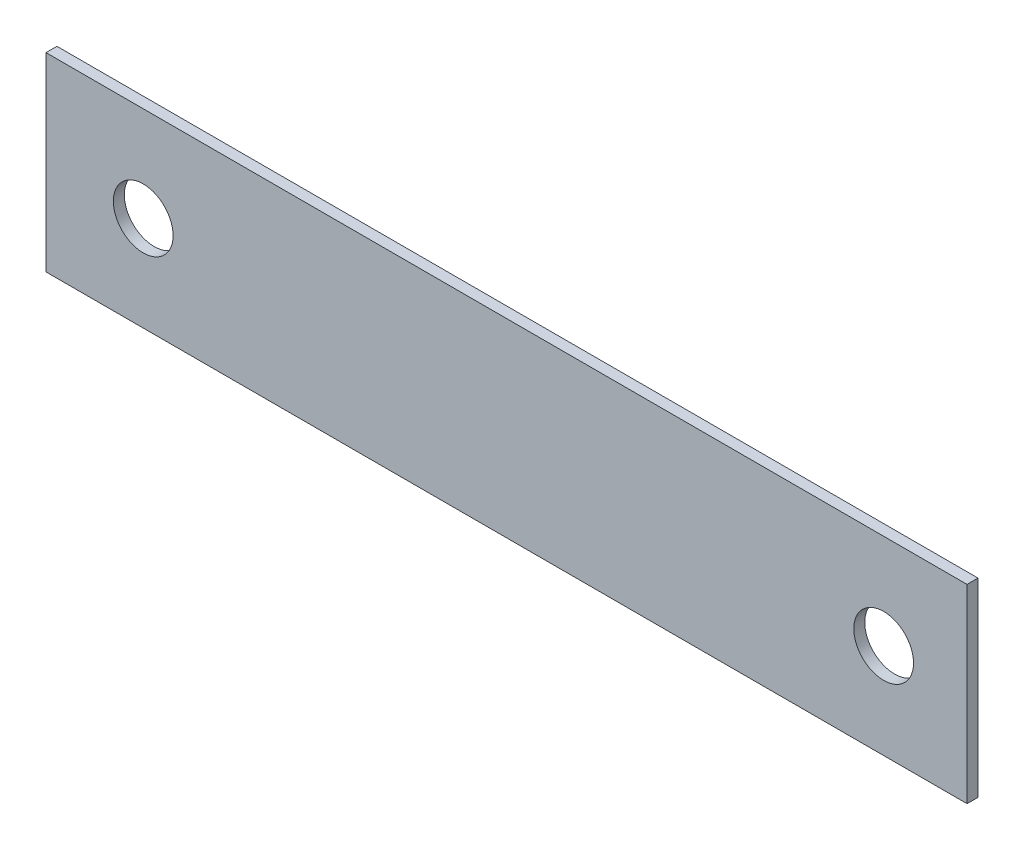
ISO-10303-21;
HEADER;
FILE_DESCRIPTION(('STEP AP214'),'2;1');
FILE_NAME('part.step','',(''),(''),'','','');
FILE_SCHEMA(('AUTOMOTIVE_DESIGN { 1 0 10303 214 1 1 1 1 }'));
ENDSEC;
DATA;
#1=APPLICATION_CONTEXT('core data for automotive mechanical design processes');
#2=APPLICATION_PROTOCOL_DEFINITION('international standard','automotive_design',2000,#1);
#3=PRODUCT_CONTEXT('',#1,'mechanical');
#4=PRODUCT('Part','Part','',(#3));
#5=PRODUCT_RELATED_PRODUCT_CATEGORY('part','',(#4));
#6=PRODUCT_DEFINITION_FORMATION('','',#4);
#7=PRODUCT_DEFINITION_CONTEXT('part definition',#1,'design');
#8=PRODUCT_DEFINITION('design','',#6,#7);
#9=PRODUCT_DEFINITION_SHAPE('','',#8);
#10=(LENGTH_UNIT() NAMED_UNIT(*) SI_UNIT(.MILLI.,.METRE.));
#11=(NAMED_UNIT(*) PLANE_ANGLE_UNIT() SI_UNIT($,.RADIAN.));
#12=(NAMED_UNIT(*) SI_UNIT($,.STERADIAN.) SOLID_ANGLE_UNIT());
#13=UNCERTAINTY_MEASURE_WITH_UNIT(LENGTH_MEASURE(1.E-05),#10,'distance_accuracy_value','');
#14=(GEOMETRIC_REPRESENTATION_CONTEXT(3) GLOBAL_UNCERTAINTY_ASSIGNED_CONTEXT((#13)) GLOBAL_UNIT_ASSIGNED_CONTEXT((#10,
#11,#12)) REPRESENTATION_CONTEXT('',''));
#15=CARTESIAN_POINT('',(0.,0.,0.));
#16=DIRECTION('',(0.,0.,1.));
#17=DIRECTION('',(1.,0.,0.));
#18=AXIS2_PLACEMENT_3D('',#15,#16,#17);
#19=CARTESIAN_POINT('',(0.,0.,0.));
#20=DIRECTION('',(0.,0.,-1.));
#21=DIRECTION('',(-1.,0.,0.));
#22=AXIS2_PLACEMENT_3D('',#19,#20,#21);
#23=PLANE('',#22);
#24=CARTESIAN_POINT('',(-14.5941080196399,0.,0.));
#25=DIRECTION('',(0.,0.,1.));
#26=DIRECTION('',(1.,0.,0.));
#27=AXIS2_PLACEMENT_3D('',#24,#25,#26);
#28=CIRCLE('',#27,1.2);
#29=CARTESIAN_POINT('',(-13.3941080196399,0.,0.));
#30=VERTEX_POINT('',#29);
#31=EDGE_CURVE('E244',#30,#30,#28,.T.);
#32=ORIENTED_EDGE('',*,*,#31,.T.);
#33=EDGE_LOOP('',(#32));
#34=FACE_BOUND('',#33,.T.);
#35=DIRECTION('',(0.,1.,0.));
#36=VECTOR('',#35,1.);
#37=CARTESIAN_POINT('',(18.5,-3.815,0.));
#38=LINE('',#37,#36);
#39=CARTESIAN_POINT('',(18.5,-3.815,0.));
#40=VERTEX_POINT('',#39);
#41=CARTESIAN_POINT('',(18.5,3.815,0.));
#42=VERTEX_POINT('',#41);
#43=EDGE_CURVE('E252',#40,#42,#38,.T.);
#44=ORIENTED_EDGE('',*,*,#43,.F.);
#45=DIRECTION('',(1.,0.,0.));
#46=VECTOR('',#45,1.);
#47=CARTESIAN_POINT('',(-18.5,-3.815,0.));
#48=LINE('',#47,#46);
#49=CARTESIAN_POINT('',(-18.5,-3.815,0.));
#50=VERTEX_POINT('',#49);
#51=EDGE_CURVE('E261',#50,#40,#48,.T.);
#52=ORIENTED_EDGE('',*,*,#51,.F.);
#53=DIRECTION('',(0.,-1.,0.));
#54=VECTOR('',#53,1.);
#55=CARTESIAN_POINT('',(-18.5,-3.815,0.));
#56=LINE('',#55,#54);
#57=CARTESIAN_POINT('',(-18.5,3.815,0.));
#58=VERTEX_POINT('',#57);
#59=EDGE_CURVE('E277',#58,#50,#56,.T.);
#60=ORIENTED_EDGE('',*,*,#59,.F.);
#61=DIRECTION('',(-1.,0.,0.));
#62=VECTOR('',#61,1.);
#63=CARTESIAN_POINT('',(-18.5,3.815,0.));
#64=LINE('',#63,#62);
#65=EDGE_CURVE('E274',#42,#58,#64,.T.);
#66=ORIENTED_EDGE('',*,*,#65,.F.);
#67=EDGE_LOOP('',(#44,#52,#60,#66));
#68=FACE_BOUND('',#67,.T.);
#69=CARTESIAN_POINT('',(15.15,0.,0.));
#70=DIRECTION('',(0.,0.,1.));
#71=DIRECTION('',(1.,0.,0.));
#72=AXIS2_PLACEMENT_3D('',#69,#70,#71);
#73=CIRCLE('',#72,1.2);
#74=CARTESIAN_POINT('',(16.35,0.,0.));
#75=VERTEX_POINT('',#74);
#76=EDGE_CURVE('E230',#75,#75,#73,.T.);
#77=ORIENTED_EDGE('',*,*,#76,.T.);
#78=EDGE_LOOP('',(#77));
#79=FACE_BOUND('',#78,.T.);
#80=DIRECTION('',(1.,0.,0.));
#81=VECTOR('',#80,1.);
#82=CARTESIAN_POINT('',(-10.145,2.71,0.));
#83=LINE('',#82,#81);
#84=CARTESIAN_POINT('',(-10.145,2.71,0.));
#85=VERTEX_POINT('',#84);
#86=CARTESIAN_POINT('',(-5.295,2.71,0.));
#87=VERTEX_POINT('',#86);
#88=EDGE_CURVE('E234',#85,#87,#83,.T.);
#89=ORIENTED_EDGE('',*,*,#88,.F.);
#90=DIRECTION('',(0.,-1.,0.));
#91=VECTOR('',#90,1.);
#92=CARTESIAN_POINT('',(-10.145,2.71,0.));
#93=LINE('',#92,#91);
#94=CARTESIAN_POINT('',(-10.145,-2.71,0.));
#95=VERTEX_POINT('',#94);
#96=EDGE_CURVE('E67',#85,#95,#93,.T.);
#97=ORIENTED_EDGE('',*,*,#96,.T.);
#98=DIRECTION('',(1.,0.,0.));
#99=VECTOR('',#98,1.);
#100=CARTESIAN_POINT('',(-10.145,-2.71,0.));
#101=LINE('',#100,#99);
#102=CARTESIAN_POINT('',(-5.295,-2.71,0.));
#103=VERTEX_POINT('',#102);
#104=EDGE_CURVE('E231',#95,#103,#101,.T.);
#105=ORIENTED_EDGE('',*,*,#104,.T.);
#106=DIRECTION('',(0.,-1.,0.));
#107=VECTOR('',#106,1.);
#108=CARTESIAN_POINT('',(-5.295,2.71,0.));
#109=LINE('',#108,#107);
#110=EDGE_CURVE('E220',#87,#103,#109,.T.);
#111=ORIENTED_EDGE('',*,*,#110,.F.);
#112=EDGE_LOOP('',(#89,#97,#105,#111));
#113=FACE_BOUND('',#112,.T.);
#114=DIRECTION('',(0.,-1.,0.));
#115=VECTOR('',#114,1.);
#116=CARTESIAN_POINT('',(10.145,2.71,0.));
#117=LINE('',#116,#115);
#118=CARTESIAN_POINT('',(10.145,2.71,0.));
#119=VERTEX_POINT('',#118);
#120=CARTESIAN_POINT('',(10.145,-2.71,0.));
#121=VERTEX_POINT('',#120);
#122=EDGE_CURVE('E138',#119,#121,#117,.T.);
#123=ORIENTED_EDGE('',*,*,#122,.F.);
#124=DIRECTION('',(-1.,0.,0.));
#125=VECTOR('',#124,1.);
#126=CARTESIAN_POINT('',(10.145,2.71,0.));
#127=LINE('',#126,#125);
#128=CARTESIAN_POINT('',(5.295,2.71,0.));
#129=VERTEX_POINT('',#128);
#130=EDGE_CURVE('E183',#119,#129,#127,.T.);
#131=ORIENTED_EDGE('',*,*,#130,.T.);
#132=DIRECTION('',(0.,-1.,0.));
#133=VECTOR('',#132,1.);
#134=CARTESIAN_POINT('',(5.295,2.71,0.));
#135=LINE('',#134,#133);
#136=CARTESIAN_POINT('',(5.295,-2.71,0.));
#137=VERTEX_POINT('',#136);
#138=EDGE_CURVE('E161',#129,#137,#135,.T.);
#139=ORIENTED_EDGE('',*,*,#138,.T.);
#140=DIRECTION('',(-1.,0.,0.));
#141=VECTOR('',#140,1.);
#142=CARTESIAN_POINT('',(10.145,-2.71,0.));
#143=LINE('',#142,#141);
#144=EDGE_CURVE('E151',#121,#137,#143,.T.);
#145=ORIENTED_EDGE('',*,*,#144,.F.);
#146=EDGE_LOOP('',(#123,#131,#139,#145));
#147=FACE_BOUND('',#146,.T.);
#148=ADVANCED_FACE('F43',(#34,#68,#79,#113,#147),#23,.T.);
#149=CARTESIAN_POINT('',(0.,0.,0.44));
#150=DIRECTION('',(0.,0.,-1.));
#151=DIRECTION('',(-1.,0.,0.));
#152=AXIS2_PLACEMENT_3D('',#149,#150,#151);
#153=PLANE('',#152);
#154=DIRECTION('',(0.,1.,0.));
#155=VECTOR('',#154,1.);
#156=CARTESIAN_POINT('',(18.5,-3.815,0.44));
#157=LINE('',#156,#155);
#158=CARTESIAN_POINT('',(18.5,-3.815,0.44));
#159=VERTEX_POINT('',#158);
#160=CARTESIAN_POINT('',(18.5,3.815,0.44));
#161=VERTEX_POINT('',#160);
#162=EDGE_CURVE('E256',#159,#161,#157,.T.);
#163=ORIENTED_EDGE('',*,*,#162,.T.);
#164=DIRECTION('',(-1.,0.,0.));
#165=VECTOR('',#164,1.);
#166=CARTESIAN_POINT('',(-18.5,3.815,0.44));
#167=LINE('',#166,#165);
#168=CARTESIAN_POINT('',(-18.5,3.815,0.44));
#169=VERTEX_POINT('',#168);
#170=EDGE_CURVE('E260',#161,#169,#167,.T.);
#171=ORIENTED_EDGE('',*,*,#170,.T.);
#172=DIRECTION('',(0.,-1.,0.));
#173=VECTOR('',#172,1.);
#174=CARTESIAN_POINT('',(-18.5,-3.815,0.44));
#175=LINE('',#174,#173);
#176=CARTESIAN_POINT('',(-18.5,-3.815,0.44));
#177=VERTEX_POINT('',#176);
#178=EDGE_CURVE('E264',#169,#177,#175,.T.);
#179=ORIENTED_EDGE('',*,*,#178,.T.);
#180=DIRECTION('',(1.,0.,0.));
#181=VECTOR('',#180,1.);
#182=CARTESIAN_POINT('',(-18.5,-3.815,0.44));
#183=LINE('',#182,#181);
#184=EDGE_CURVE('E267',#177,#159,#183,.T.);
#185=ORIENTED_EDGE('',*,*,#184,.T.);
#186=EDGE_LOOP('',(#163,#171,#179,#185));
#187=FACE_BOUND('',#186,.T.);
#188=CARTESIAN_POINT('',(-14.5941080196399,0.,0.44));
#189=DIRECTION('',(0.,0.,1.));
#190=DIRECTION('',(1.,0.,0.));
#191=AXIS2_PLACEMENT_3D('',#188,#189,#190);
#192=CIRCLE('',#191,1.2);
#193=CARTESIAN_POINT('',(-13.3941080196399,0.,0.44));
#194=VERTEX_POINT('',#193);
#195=EDGE_CURVE('E248',#194,#194,#192,.T.);
#196=ORIENTED_EDGE('',*,*,#195,.F.);
#197=EDGE_LOOP('',(#196));
#198=FACE_BOUND('',#197,.T.);
#199=CARTESIAN_POINT('',(15.15,0.,0.44));
#200=DIRECTION('',(0.,0.,1.));
#201=DIRECTION('',(1.,0.,0.));
#202=AXIS2_PLACEMENT_3D('',#199,#200,#201);
#203=CIRCLE('',#202,1.2);
#204=CARTESIAN_POINT('',(16.35,0.,0.44));
#205=VERTEX_POINT('',#204);
#206=EDGE_CURVE('E240',#205,#205,#203,.T.);
#207=ORIENTED_EDGE('',*,*,#206,.F.);
#208=EDGE_LOOP('',(#207));
#209=FACE_BOUND('',#208,.T.);
#210=ADVANCED_FACE('F309',(#187,#198,#209),#153,.F.);
#211=CARTESIAN_POINT('',(18.5,-3.815,0.44));
#212=DIRECTION('',(-1.,0.,0.));
#213=DIRECTION('',(0.,0.,1.));
#214=AXIS2_PLACEMENT_3D('',#211,#212,#213);
#215=PLANE('',#214);
#216=ORIENTED_EDGE('',*,*,#43,.T.);
#217=DIRECTION('',(0.,0.,-1.));
#218=VECTOR('',#217,1.);
#219=CARTESIAN_POINT('',(18.5,3.815,0.44));
#220=LINE('',#219,#218);
#221=EDGE_CURVE('E11',#161,#42,#220,.T.);
#222=ORIENTED_EDGE('',*,*,#221,.F.);
#223=ORIENTED_EDGE('',*,*,#162,.F.);
#224=DIRECTION('',(0.,0.,-1.));
#225=VECTOR('',#224,1.);
#226=CARTESIAN_POINT('',(18.5,-3.815,0.44));
#227=LINE('',#226,#225);
#228=EDGE_CURVE('E270',#159,#40,#227,.T.);
#229=ORIENTED_EDGE('',*,*,#228,.T.);
#230=EDGE_LOOP('',(#216,#222,#223,#229));
#231=FACE_BOUND('',#230,.T.);
#232=ADVANCED_FACE('F45',(#231),#215,.F.);
#233=CARTESIAN_POINT('',(-18.5,3.815,0.44));
#234=DIRECTION('',(0.,-1.,0.));
#235=DIRECTION('',(0.,0.,-1.));
#236=AXIS2_PLACEMENT_3D('',#233,#234,#235);
#237=PLANE('',#236);
#238=ORIENTED_EDGE('',*,*,#65,.T.);
#239=DIRECTION('',(0.,0.,-1.));
#240=VECTOR('',#239,1.);
#241=CARTESIAN_POINT('',(-18.5,3.815,0.44));
#242=LINE('',#241,#240);
#243=EDGE_CURVE('E52',#169,#58,#242,.T.);
#244=ORIENTED_EDGE('',*,*,#243,.F.);
#245=ORIENTED_EDGE('',*,*,#170,.F.);
#246=ORIENTED_EDGE('',*,*,#221,.T.);
#247=EDGE_LOOP('',(#238,#244,#245,#246));
#248=FACE_BOUND('',#247,.T.);
#249=ADVANCED_FACE('F311',(#248),#237,.F.);
#250=CARTESIAN_POINT('',(-18.5,-3.815,0.44));
#251=DIRECTION('',(1.,0.,0.));
#252=DIRECTION('',(0.,0.,-1.));
#253=AXIS2_PLACEMENT_3D('',#250,#251,#252);
#254=PLANE('',#253);
#255=ORIENTED_EDGE('',*,*,#59,.T.);
#256=DIRECTION('',(0.,0.,-1.));
#257=VECTOR('',#256,1.);
#258=CARTESIAN_POINT('',(-18.5,-3.815,0.44));
#259=LINE('',#258,#257);
#260=EDGE_CURVE('E285',#177,#50,#259,.T.);
#261=ORIENTED_EDGE('',*,*,#260,.F.);
#262=ORIENTED_EDGE('',*,*,#178,.F.);
#263=ORIENTED_EDGE('',*,*,#243,.T.);
#264=EDGE_LOOP('',(#255,#261,#262,#263));
#265=FACE_BOUND('',#264,.T.);
#266=ADVANCED_FACE('F294',(#265),#254,.F.);
#267=CARTESIAN_POINT('',(-18.5,-3.815,0.44));
#268=DIRECTION('',(0.,1.,0.));
#269=DIRECTION('',(0.,0.,1.));
#270=AXIS2_PLACEMENT_3D('',#267,#268,#269);
#271=PLANE('',#270);
#272=ORIENTED_EDGE('',*,*,#51,.T.);
#273=ORIENTED_EDGE('',*,*,#228,.F.);
#274=ORIENTED_EDGE('',*,*,#184,.F.);
#275=ORIENTED_EDGE('',*,*,#260,.T.);
#276=EDGE_LOOP('',(#272,#273,#274,#275));
#277=FACE_BOUND('',#276,.T.);
#278=ADVANCED_FACE('F303',(#277),#271,.F.);
#279=CARTESIAN_POINT('',(-14.5941080196399,0.,0.44));
#280=DIRECTION('',(0.,0.,-1.));
#281=DIRECTION('',(-1.,0.,0.));
#282=AXIS2_PLACEMENT_3D('',#279,#280,#281);
#283=CYLINDRICAL_SURFACE('',#282,1.2);
#284=ORIENTED_EDGE('',*,*,#195,.T.);
#285=EDGE_LOOP('',(#284));
#286=FACE_BOUND('',#285,.T.);
#287=ORIENTED_EDGE('',*,*,#31,.F.);
#288=EDGE_LOOP('',(#287));
#289=FACE_BOUND('',#288,.T.);
#290=ADVANCED_FACE('F328',(#286,#289),#283,.F.);
#291=CARTESIAN_POINT('',(15.15,0.,0.44));
#292=DIRECTION('',(0.,0.,-1.));
#293=DIRECTION('',(-1.,0.,0.));
#294=AXIS2_PLACEMENT_3D('',#291,#292,#293);
#295=CYLINDRICAL_SURFACE('',#294,1.2);
#296=ORIENTED_EDGE('',*,*,#206,.T.);
#297=EDGE_LOOP('',(#296));
#298=FACE_BOUND('',#297,.T.);
#299=ORIENTED_EDGE('',*,*,#76,.F.);
#300=EDGE_LOOP('',(#299));
#301=FACE_BOUND('',#300,.T.);
#302=ADVANCED_FACE('F332',(#298,#301),#295,.F.);
#303=CARTESIAN_POINT('',(-10.145,0.,-1.5));
#304=DIRECTION('',(1.,0.,0.));
#305=DIRECTION('',(0.,0.,-1.));
#306=AXIS2_PLACEMENT_3D('',#303,#304,#305);
#307=CYLINDRICAL_SURFACE('',#306,1.15);
#308=CARTESIAN_POINT('',(-5.295,0.,-1.5));
#309=DIRECTION('',(1.,0.,0.));
#310=DIRECTION('',(0.,0.,-1.));
#311=AXIS2_PLACEMENT_3D('',#308,#309,#310);
#312=CIRCLE('',#311,1.15);
#313=CARTESIAN_POINT('',(-5.295,-0.890666365389084,-2.22747056680295));
#314=VERTEX_POINT('',#313);
#315=CARTESIAN_POINT('',(-5.295,0.890666365389085,-2.22747056680295));
#316=VERTEX_POINT('',#315);
#317=EDGE_CURVE('E193',#314,#316,#312,.T.);
#318=ORIENTED_EDGE('',*,*,#317,.F.);
#319=DIRECTION('',(1.,0.,0.));
#320=VECTOR('',#319,1.);
#321=CARTESIAN_POINT('',(-10.145,-0.890666365389084,-2.22747056680295));
#322=LINE('',#321,#320);
#323=CARTESIAN_POINT('',(-10.145,-0.890666365389084,-2.22747056680295));
#324=VERTEX_POINT('',#323);
#325=EDGE_CURVE('E227',#324,#314,#322,.T.);
#326=ORIENTED_EDGE('',*,*,#325,.F.);
#327=CARTESIAN_POINT('',(-10.145,0.,-1.5));
#328=DIRECTION('',(1.,0.,0.));
#329=DIRECTION('',(0.,0.,-1.));
#330=AXIS2_PLACEMENT_3D('',#327,#328,#329);
#331=CIRCLE('',#330,1.15);
#332=CARTESIAN_POINT('',(-10.145,0.890666365389085,-2.22747056680295));
#333=VERTEX_POINT('',#332);
#334=EDGE_CURVE('E197',#324,#333,#331,.T.);
#335=ORIENTED_EDGE('',*,*,#334,.T.);
#336=DIRECTION('',(1.,0.,0.));
#337=VECTOR('',#336,1.);
#338=CARTESIAN_POINT('',(-10.145,0.890666365389085,-2.22747056680295));
#339=LINE('',#338,#337);
#340=EDGE_CURVE('E212',#333,#316,#339,.T.);
#341=ORIENTED_EDGE('',*,*,#340,.T.);
#342=EDGE_LOOP('',(#318,#326,#335,#341));
#343=FACE_BOUND('',#342,.T.);
#344=ADVANCED_FACE('F337',(#343),#307,.T.);
#345=CARTESIAN_POINT('',(-10.145,-0.890666365389084,-2.22747056680295));
#346=DIRECTION('',(0.,-0.774492491642682,-0.632583101567779));
#347=DIRECTION('',(0.,0.632583101567779,-0.774492491642682));
#348=AXIS2_PLACEMENT_3D('',#345,#346,#347);
#349=PLANE('',#348);
#350=DIRECTION('',(0.,0.632583101567779,-0.774492491642682));
#351=VECTOR('',#350,1.);
#352=CARTESIAN_POINT('',(-5.295,-0.890666365389084,-2.22747056680295));
#353=LINE('',#352,#351);
#354=EDGE_CURVE('E202',#103,#314,#353,.T.);
#355=ORIENTED_EDGE('',*,*,#354,.F.);
#356=ORIENTED_EDGE('',*,*,#104,.F.);
#357=DIRECTION('',(0.,0.632583101567779,-0.774492491642682));
#358=VECTOR('',#357,1.);
#359=CARTESIAN_POINT('',(-10.145,-0.890666365389084,-2.22747056680295));
#360=LINE('',#359,#358);
#361=EDGE_CURVE('E208',#95,#324,#360,.T.);
#362=ORIENTED_EDGE('',*,*,#361,.T.);
#363=ORIENTED_EDGE('',*,*,#325,.T.);
#364=EDGE_LOOP('',(#355,#356,#362,#363));
#365=FACE_BOUND('',#364,.T.);
#366=ADVANCED_FACE('F344',(#365),#349,.T.);
#367=CARTESIAN_POINT('',(-10.145,0.890666365389085,-2.22747056680295));
#368=DIRECTION('',(0.,0.774492491642682,-0.632583101567778));
#369=DIRECTION('',(0.,0.632583101567778,0.774492491642682));
#370=AXIS2_PLACEMENT_3D('',#367,#368,#369);
#371=PLANE('',#370);
#372=DIRECTION('',(0.,0.632583101567778,0.774492491642682));
#373=VECTOR('',#372,1.);
#374=CARTESIAN_POINT('',(-5.295,0.890666365389085,-2.22747056680295));
#375=LINE('',#374,#373);
#376=EDGE_CURVE('E216',#316,#87,#375,.T.);
#377=ORIENTED_EDGE('',*,*,#376,.F.);
#378=ORIENTED_EDGE('',*,*,#340,.F.);
#379=DIRECTION('',(0.,0.632583101567778,0.774492491642682));
#380=VECTOR('',#379,1.);
#381=CARTESIAN_POINT('',(-10.145,0.890666365389085,-2.22747056680295));
#382=LINE('',#381,#380);
#383=EDGE_CURVE('E201',#333,#85,#382,.T.);
#384=ORIENTED_EDGE('',*,*,#383,.T.);
#385=ORIENTED_EDGE('',*,*,#88,.T.);
#386=EDGE_LOOP('',(#377,#378,#384,#385));
#387=FACE_BOUND('',#386,.T.);
#388=ADVANCED_FACE('F346',(#387),#371,.T.);
#389=CARTESIAN_POINT('',(-10.145,0.,-1.5));
#390=DIRECTION('',(1.,0.,0.));
#391=DIRECTION('',(0.,0.,-1.));
#392=AXIS2_PLACEMENT_3D('',#389,#390,#391);
#393=PLANE('',#392);
#394=CARTESIAN_POINT('',(-10.145,0.,-1.5));
#395=DIRECTION('',(1.,0.,0.));
#396=DIRECTION('',(0.,0.,-1.));
#397=AXIS2_PLACEMENT_3D('',#394,#395,#396);
#398=CIRCLE('',#397,1.05);
#399=CARTESIAN_POINT('',(-10.145,0.,-2.55));
#400=VERTEX_POINT('',#399);
#401=EDGE_CURVE('E189',#400,#400,#398,.T.);
#402=ORIENTED_EDGE('',*,*,#401,.T.);
#403=EDGE_LOOP('',(#402));
#404=FACE_BOUND('',#403,.T.);
#405=ORIENTED_EDGE('',*,*,#334,.F.);
#406=ORIENTED_EDGE('',*,*,#361,.F.);
#407=ORIENTED_EDGE('',*,*,#96,.F.);
#408=ORIENTED_EDGE('',*,*,#383,.F.);
#409=EDGE_LOOP('',(#405,#406,#407,#408));
#410=FACE_BOUND('',#409,.T.);
#411=ADVANCED_FACE('F349',(#404,#410),#393,.F.);
#412=CARTESIAN_POINT('',(-5.295,0.,-1.5));
#413=DIRECTION('',(1.,0.,0.));
#414=DIRECTION('',(0.,0.,-1.));
#415=AXIS2_PLACEMENT_3D('',#412,#413,#414);
#416=PLANE('',#415);
#417=CARTESIAN_POINT('',(-5.295,0.,-1.5));
#418=DIRECTION('',(1.,0.,0.));
#419=DIRECTION('',(0.,0.,-1.));
#420=AXIS2_PLACEMENT_3D('',#417,#418,#419);
#421=CIRCLE('',#420,1.05);
#422=CARTESIAN_POINT('',(-5.295,0.,-2.55));
#423=VERTEX_POINT('',#422);
#424=EDGE_CURVE('E182',#423,#423,#421,.T.);
#425=ORIENTED_EDGE('',*,*,#424,.F.);
#426=EDGE_LOOP('',(#425));
#427=FACE_BOUND('',#426,.T.);
#428=ORIENTED_EDGE('',*,*,#317,.T.);
#429=ORIENTED_EDGE('',*,*,#376,.T.);
#430=ORIENTED_EDGE('',*,*,#110,.T.);
#431=ORIENTED_EDGE('',*,*,#354,.T.);
#432=EDGE_LOOP('',(#428,#429,#430,#431));
#433=FACE_BOUND('',#432,.T.);
#434=ADVANCED_FACE('F354',(#427,#433),#416,.T.);
#435=CARTESIAN_POINT('',(-10.145,0.,-1.5));
#436=DIRECTION('',(1.,0.,0.));
#437=DIRECTION('',(0.,0.,-1.));
#438=AXIS2_PLACEMENT_3D('',#435,#436,#437);
#439=CYLINDRICAL_SURFACE('',#438,1.05);
#440=ORIENTED_EDGE('',*,*,#401,.F.);
#441=EDGE_LOOP('',(#440));
#442=FACE_BOUND('',#441,.T.);
#443=ORIENTED_EDGE('',*,*,#424,.T.);
#444=EDGE_LOOP('',(#443));
#445=FACE_BOUND('',#444,.T.);
#446=ADVANCED_FACE('F357',(#442,#445),#439,.F.);
#447=CARTESIAN_POINT('',(10.145,0.,-1.5));
#448=DIRECTION('',(-1.,0.,0.));
#449=DIRECTION('',(0.,0.,-1.));
#450=AXIS2_PLACEMENT_3D('',#447,#448,#449);
#451=PLANE('',#450);
#452=CARTESIAN_POINT('',(10.145,0.,-1.5));
#453=DIRECTION('',(1.,0.,0.));
#454=DIRECTION('',(0.,0.,-1.));
#455=AXIS2_PLACEMENT_3D('',#452,#453,#454);
#456=CIRCLE('',#455,1.15);
#457=CARTESIAN_POINT('',(10.145,-0.890666365389084,-2.22747056680295));
#458=VERTEX_POINT('',#457);
#459=CARTESIAN_POINT('',(10.145,0.890666365389085,-2.22747056680295));
#460=VERTEX_POINT('',#459);
#461=EDGE_CURVE('E135',#458,#460,#456,.T.);
#462=ORIENTED_EDGE('',*,*,#461,.T.);
#463=DIRECTION('',(0.,0.632583101567778,0.774492491642682));
#464=VECTOR('',#463,1.);
#465=CARTESIAN_POINT('',(10.145,0.890666365389085,-2.22747056680295));
#466=LINE('',#465,#464);
#467=EDGE_CURVE('E152',#460,#119,#466,.T.);
#468=ORIENTED_EDGE('',*,*,#467,.T.);
#469=ORIENTED_EDGE('',*,*,#122,.T.);
#470=DIRECTION('',(0.,0.632583101567779,-0.774492491642682));
#471=VECTOR('',#470,1.);
#472=CARTESIAN_POINT('',(10.145,-0.890666365389084,-2.22747056680295));
#473=LINE('',#472,#471);
#474=EDGE_CURVE('E59',#121,#458,#473,.T.);
#475=ORIENTED_EDGE('',*,*,#474,.T.);
#476=EDGE_LOOP('',(#462,#468,#469,#475));
#477=FACE_BOUND('',#476,.T.);
#478=CARTESIAN_POINT('',(10.145,0.,-1.5));
#479=DIRECTION('',(1.,0.,0.));
#480=DIRECTION('',(0.,0.,-1.));
#481=AXIS2_PLACEMENT_3D('',#478,#479,#480);
#482=CIRCLE('',#481,1.05);
#483=CARTESIAN_POINT('',(10.145,0.,-2.55));
#484=VERTEX_POINT('',#483);
#485=EDGE_CURVE('E174',#484,#484,#482,.T.);
#486=ORIENTED_EDGE('',*,*,#485,.F.);
#487=EDGE_LOOP('',(#486));
#488=FACE_BOUND('',#487,.T.);
#489=ADVANCED_FACE('F132',(#477,#488),#451,.F.);
#490=CARTESIAN_POINT('',(5.295,0.,-1.5));
#491=DIRECTION('',(-1.,0.,0.));
#492=DIRECTION('',(0.,0.,-1.));
#493=AXIS2_PLACEMENT_3D('',#490,#491,#492);
#494=PLANE('',#493);
#495=CARTESIAN_POINT('',(5.295,0.,-1.5));
#496=DIRECTION('',(1.,0.,0.));
#497=DIRECTION('',(0.,0.,-1.));
#498=AXIS2_PLACEMENT_3D('',#495,#496,#497);
#499=CIRCLE('',#498,1.15);
#500=CARTESIAN_POINT('',(5.295,-0.890666365389084,-2.22747056680295));
#501=VERTEX_POINT('',#500);
#502=CARTESIAN_POINT('',(5.295,0.890666365389085,-2.22747056680295));
#503=VERTEX_POINT('',#502);
#504=EDGE_CURVE('E171',#501,#503,#499,.T.);
#505=ORIENTED_EDGE('',*,*,#504,.F.);
#506=DIRECTION('',(0.,0.632583101567779,-0.774492491642682));
#507=VECTOR('',#506,1.);
#508=CARTESIAN_POINT('',(5.295,-0.890666365389084,-2.22747056680295));
#509=LINE('',#508,#507);
#510=EDGE_CURVE('E146',#137,#501,#509,.T.);
#511=ORIENTED_EDGE('',*,*,#510,.F.);
#512=ORIENTED_EDGE('',*,*,#138,.F.);
#513=DIRECTION('',(0.,0.632583101567778,0.774492491642682));
#514=VECTOR('',#513,1.);
#515=CARTESIAN_POINT('',(5.295,0.890666365389085,-2.22747056680295));
#516=LINE('',#515,#514);
#517=EDGE_CURVE('E158',#503,#129,#516,.T.);
#518=ORIENTED_EDGE('',*,*,#517,.F.);
#519=EDGE_LOOP('',(#505,#511,#512,#518));
#520=FACE_BOUND('',#519,.T.);
#521=CARTESIAN_POINT('',(5.295,0.,-1.5));
#522=DIRECTION('',(1.,0.,0.));
#523=DIRECTION('',(0.,0.,-1.));
#524=AXIS2_PLACEMENT_3D('',#521,#522,#523);
#525=CIRCLE('',#524,1.05);
#526=CARTESIAN_POINT('',(5.295,0.,-2.55));
#527=VERTEX_POINT('',#526);
#528=EDGE_CURVE('E164',#527,#527,#525,.T.);
#529=ORIENTED_EDGE('',*,*,#528,.T.);
#530=EDGE_LOOP('',(#529));
#531=FACE_BOUND('',#530,.T.);
#532=ADVANCED_FACE('F368',(#520,#531),#494,.T.);
#533=CARTESIAN_POINT('',(10.145,0.,-1.5));
#534=DIRECTION('',(-1.,0.,0.));
#535=DIRECTION('',(0.,0.,1.));
#536=AXIS2_PLACEMENT_3D('',#533,#534,#535);
#537=CYLINDRICAL_SURFACE('',#536,1.15);
#538=ORIENTED_EDGE('',*,*,#504,.T.);
#539=DIRECTION('',(-1.,0.,0.));
#540=VECTOR('',#539,1.);
#541=CARTESIAN_POINT('',(10.145,0.890666365389085,-2.22747056680295));
#542=LINE('',#541,#540);
#543=EDGE_CURVE('E156',#460,#503,#542,.T.);
#544=ORIENTED_EDGE('',*,*,#543,.F.);
#545=ORIENTED_EDGE('',*,*,#461,.F.);
#546=DIRECTION('',(-1.,0.,0.));
#547=VECTOR('',#546,1.);
#548=CARTESIAN_POINT('',(10.145,-0.890666365389084,-2.22747056680295));
#549=LINE('',#548,#547);
#550=EDGE_CURVE('E143',#458,#501,#549,.T.);
#551=ORIENTED_EDGE('',*,*,#550,.T.);
#552=EDGE_LOOP('',(#538,#544,#545,#551));
#553=FACE_BOUND('',#552,.T.);
#554=ADVANCED_FACE('F154',(#553),#537,.T.);
#555=CARTESIAN_POINT('',(10.145,0.890666365389085,-2.22747056680295));
#556=DIRECTION('',(0.,-0.774492491642682,0.632583101567778));
#557=DIRECTION('',(0.,-0.632583101567778,-0.774492491642682));
#558=AXIS2_PLACEMENT_3D('',#555,#556,#557);
#559=PLANE('',#558);
#560=ORIENTED_EDGE('',*,*,#517,.T.);
#561=ORIENTED_EDGE('',*,*,#130,.F.);
#562=ORIENTED_EDGE('',*,*,#467,.F.);
#563=ORIENTED_EDGE('',*,*,#543,.T.);
#564=EDGE_LOOP('',(#560,#561,#562,#563));
#565=FACE_BOUND('',#564,.T.);
#566=ADVANCED_FACE('F367',(#565),#559,.F.);
#567=CARTESIAN_POINT('',(10.145,-0.890666365389084,-2.22747056680295));
#568=DIRECTION('',(0.,0.774492491642682,0.632583101567779));
#569=DIRECTION('',(0.,-0.632583101567779,0.774492491642682));
#570=AXIS2_PLACEMENT_3D('',#567,#568,#569);
#571=PLANE('',#570);
#572=ORIENTED_EDGE('',*,*,#510,.T.);
#573=ORIENTED_EDGE('',*,*,#550,.F.);
#574=ORIENTED_EDGE('',*,*,#474,.F.);
#575=ORIENTED_EDGE('',*,*,#144,.T.);
#576=EDGE_LOOP('',(#572,#573,#574,#575));
#577=FACE_BOUND('',#576,.T.);
#578=ADVANCED_FACE('F144',(#577),#571,.F.);
#579=CARTESIAN_POINT('',(10.145,0.,-1.5));
#580=DIRECTION('',(-1.,0.,0.));
#581=DIRECTION('',(0.,0.,1.));
#582=AXIS2_PLACEMENT_3D('',#579,#580,#581);
#583=CYLINDRICAL_SURFACE('',#582,1.05);
#584=ORIENTED_EDGE('',*,*,#485,.T.);
#585=EDGE_LOOP('',(#584));
#586=FACE_BOUND('',#585,.T.);
#587=ORIENTED_EDGE('',*,*,#528,.F.);
#588=EDGE_LOOP('',(#587));
#589=FACE_BOUND('',#588,.T.);
#590=ADVANCED_FACE('F371',(#586,#589),#583,.F.);
#591=CLOSED_SHELL('',(#148,#210,#232,#249,#266,#278,#290,#302,#344,#366,#388,#411,#434,#446,
#489,#532,#554,#566,#578,#590));
#592=MANIFOLD_SOLID_BREP('B2',#591);
#593=ADVANCED_BREP_SHAPE_REPRESENTATION('',(#18,#592),#14);
#594=SHAPE_DEFINITION_REPRESENTATION(#9,#593);
ENDSEC;
END-ISO-10303-21;
